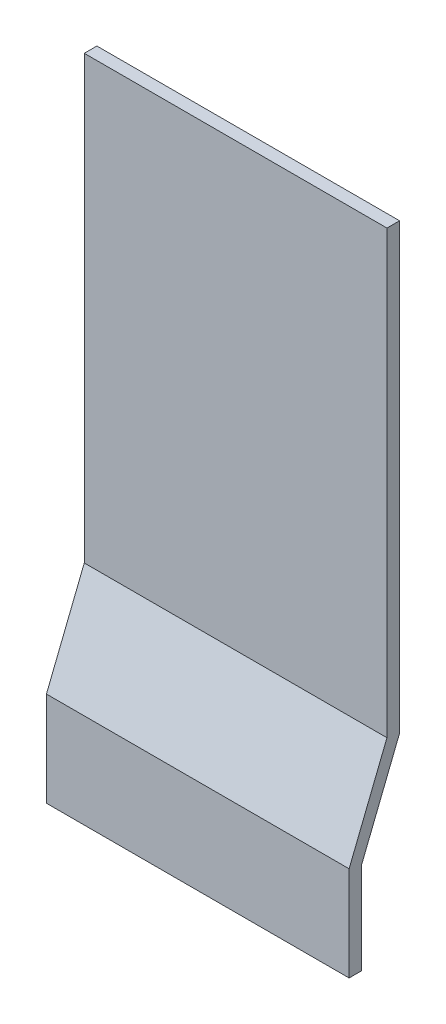
ISO-10303-21;
HEADER;
FILE_DESCRIPTION(('STEP AP214'),'2;1');
FILE_NAME('part.step','',(''),(''),'','','');
FILE_SCHEMA(('AUTOMOTIVE_DESIGN { 1 0 10303 214 1 1 1 1 }'));
ENDSEC;
DATA;
#1=APPLICATION_CONTEXT('core data for automotive mechanical design processes');
#2=APPLICATION_PROTOCOL_DEFINITION('international standard','automotive_design',2000,#1);
#3=PRODUCT_CONTEXT('',#1,'mechanical');
#4=PRODUCT('Part','Part','',(#3));
#5=PRODUCT_RELATED_PRODUCT_CATEGORY('part','',(#4));
#6=PRODUCT_DEFINITION_FORMATION('','',#4);
#7=PRODUCT_DEFINITION_CONTEXT('part definition',#1,'design');
#8=PRODUCT_DEFINITION('design','',#6,#7);
#9=PRODUCT_DEFINITION_SHAPE('','',#8);
#10=(LENGTH_UNIT() NAMED_UNIT(*) SI_UNIT(.MILLI.,.METRE.));
#11=(NAMED_UNIT(*) PLANE_ANGLE_UNIT() SI_UNIT($,.RADIAN.));
#12=(NAMED_UNIT(*) SI_UNIT($,.STERADIAN.) SOLID_ANGLE_UNIT());
#13=UNCERTAINTY_MEASURE_WITH_UNIT(LENGTH_MEASURE(1.E-05),#10,'distance_accuracy_value','');
#14=(GEOMETRIC_REPRESENTATION_CONTEXT(3) GLOBAL_UNCERTAINTY_ASSIGNED_CONTEXT((#13)) GLOBAL_UNIT_ASSIGNED_CONTEXT((#10,
#11,#12)) REPRESENTATION_CONTEXT('',''));
#15=CARTESIAN_POINT('',(0.,0.,0.));
#16=DIRECTION('',(0.,0.,1.));
#17=DIRECTION('',(1.,0.,0.));
#18=AXIS2_PLACEMENT_3D('',#15,#16,#17);
#19=CARTESIAN_POINT('',(-20.47728245926,4.697980609798,-26.23448402181));
#20=DIRECTION('',(0.,0.,-1.));
#21=DIRECTION('',(-1.,0.,0.));
#22=AXIS2_PLACEMENT_3D('',#19,#20,#21);
#23=PLANE('',#22);
#24=DIRECTION('',(0.,1.,0.));
#25=VECTOR('',#24,1.);
#26=CARTESIAN_POINT('',(-22.87728245926,4.697980609798,-26.23448402181));
#27=LINE('',#26,#25);
#28=CARTESIAN_POINT('',(-22.87728245926,3.947980609798,-26.23448402181));
#29=VERTEX_POINT('',#28);
#30=CARTESIAN_POINT('',(-22.87728245926,4.697980609798,-26.23448402181));
#31=VERTEX_POINT('',#30);
#32=EDGE_CURVE('E78',#29,#31,#27,.T.);
#33=ORIENTED_EDGE('',*,*,#32,.F.);
#34=DIRECTION('',(1.,0.,0.));
#35=VECTOR('',#34,1.);
#36=CARTESIAN_POINT('',(-20.47728245926,3.947980609798,-26.23448402181));
#37=LINE('',#36,#35);
#38=CARTESIAN_POINT('',(-20.47728245926,3.947980609798,-26.23448402181));
#39=VERTEX_POINT('',#38);
#40=EDGE_CURVE('E88',#29,#39,#37,.T.);
#41=ORIENTED_EDGE('',*,*,#40,.T.);
#42=DIRECTION('',(0.,1.,0.));
#43=VECTOR('',#42,1.);
#44=CARTESIAN_POINT('',(-20.47728245926,4.697980609798,-26.23448402181));
#45=LINE('',#44,#43);
#46=CARTESIAN_POINT('',(-20.47728245926,4.697980609798,-26.23448402181));
#47=VERTEX_POINT('',#46);
#48=EDGE_CURVE('E20',#47,#39,#45,.F.);
#49=ORIENTED_EDGE('',*,*,#48,.F.);
#50=DIRECTION('',(1.,0.,0.));
#51=VECTOR('',#50,1.);
#52=CARTESIAN_POINT('',(-20.47728245926,4.697980609798,-26.23448402181));
#53=LINE('',#52,#51);
#54=EDGE_CURVE('E86',#47,#31,#53,.F.);
#55=ORIENTED_EDGE('',*,*,#54,.T.);
#56=EDGE_LOOP('',(#33,#41,#49,#55));
#57=FACE_BOUND('',#56,.T.);
#58=ADVANCED_FACE('F17',(#57),#23,.F.);
#59=CARTESIAN_POINT('',(-20.47728245926,5.447980609798,-26.53448402181));
#60=DIRECTION('',(0.,-0.371390676354104,-0.928476690885259));
#61=DIRECTION('',(0.,0.928476690885259,-0.371390676354104));
#62=AXIS2_PLACEMENT_3D('',#59,#60,#61);
#63=PLANE('',#62);
#64=DIRECTION('',(0.,0.928476690885259,-0.371390676354104));
#65=VECTOR('',#64,1.);
#66=CARTESIAN_POINT('',(-22.87728245926,5.447980609798,-26.53448402181));
#67=LINE('',#66,#65);
#68=CARTESIAN_POINT('',(-22.87728245926,5.447980609798,-26.53448402181));
#69=VERTEX_POINT('',#68);
#70=EDGE_CURVE('E96',#31,#69,#67,.T.);
#71=ORIENTED_EDGE('',*,*,#70,.F.);
#72=ORIENTED_EDGE('',*,*,#54,.F.);
#73=DIRECTION('',(0.,0.928476690885259,-0.371390676354104));
#74=VECTOR('',#73,1.);
#75=CARTESIAN_POINT('',(-20.47728245926,5.447980609798,-26.53448402181));
#76=LINE('',#75,#74);
#77=CARTESIAN_POINT('',(-20.47728245926,5.447980609798,-26.53448402181));
#78=VERTEX_POINT('',#77);
#79=EDGE_CURVE('E94',#78,#47,#76,.F.);
#80=ORIENTED_EDGE('',*,*,#79,.F.);
#81=DIRECTION('',(1.,0.,0.));
#82=VECTOR('',#81,1.);
#83=CARTESIAN_POINT('',(-20.47728245926,5.447980609798,-26.53448402181));
#84=LINE('',#83,#82);
#85=EDGE_CURVE('E111',#78,#69,#84,.F.);
#86=ORIENTED_EDGE('',*,*,#85,.T.);
#87=EDGE_LOOP('',(#71,#72,#80,#86));
#88=FACE_BOUND('',#87,.T.);
#89=ADVANCED_FACE('F92',(#88),#63,.F.);
#90=CARTESIAN_POINT('',(-20.47728245926,3.947980609798,-26.23448402181));
#91=DIRECTION('',(0.,1.,0.));
#92=DIRECTION('',(0.,0.,1.));
#93=AXIS2_PLACEMENT_3D('',#90,#91,#92);
#94=PLANE('',#93);
#95=DIRECTION('',(0.,0.,1.));
#96=VECTOR('',#95,1.);
#97=CARTESIAN_POINT('',(-22.87728245926,3.947980609798,-26.23448402181));
#98=LINE('',#97,#96);
#99=CARTESIAN_POINT('',(-22.87728245926,3.947980609798,-26.33448402181));
#100=VERTEX_POINT('',#99);
#101=EDGE_CURVE('E108',#100,#29,#98,.T.);
#102=ORIENTED_EDGE('',*,*,#101,.F.);
#103=DIRECTION('',(1.,0.,0.));
#104=VECTOR('',#103,1.);
#105=CARTESIAN_POINT('',(-20.47728245926,3.947980609798,-26.33448402181));
#106=LINE('',#105,#104);
#107=CARTESIAN_POINT('',(-20.47728245926,3.947980609798,-26.33448402181));
#108=VERTEX_POINT('',#107);
#109=EDGE_CURVE('E113',#100,#108,#106,.T.);
#110=ORIENTED_EDGE('',*,*,#109,.T.);
#111=DIRECTION('',(0.,0.,1.));
#112=VECTOR('',#111,1.);
#113=CARTESIAN_POINT('',(-20.47728245926,3.947980609798,-26.23448402181));
#114=LINE('',#113,#112);
#115=EDGE_CURVE('E106',#39,#108,#114,.F.);
#116=ORIENTED_EDGE('',*,*,#115,.F.);
#117=ORIENTED_EDGE('',*,*,#40,.F.);
#118=EDGE_LOOP('',(#102,#110,#116,#117));
#119=FACE_BOUND('',#118,.T.);
#120=ADVANCED_FACE('F178',(#119),#94,.F.);
#121=CARTESIAN_POINT('',(-20.47728245926,8.947980609798,-26.53448402181));
#122=DIRECTION('',(0.,0.,-1.));
#123=DIRECTION('',(0.,1.,0.));
#124=AXIS2_PLACEMENT_3D('',#121,#122,#123);
#125=PLANE('',#124);
#126=DIRECTION('',(0.,1.,0.));
#127=VECTOR('',#126,1.);
#128=CARTESIAN_POINT('',(-22.87728245926,8.947980609798,-26.53448402181));
#129=LINE('',#128,#127);
#130=CARTESIAN_POINT('',(-22.87728245926,8.947980609798,-26.53448402181));
#131=VERTEX_POINT('',#130);
#132=EDGE_CURVE('E124',#131,#69,#129,.F.);
#133=ORIENTED_EDGE('',*,*,#132,.T.);
#134=ORIENTED_EDGE('',*,*,#85,.F.);
#135=DIRECTION('',(0.,1.,0.));
#136=VECTOR('',#135,1.);
#137=CARTESIAN_POINT('',(-20.47728245926,3.947980609798,-26.53448402181));
#138=LINE('',#137,#136);
#139=CARTESIAN_POINT('',(-20.47728245926,8.947980609798,-26.53448402181));
#140=VERTEX_POINT('',#139);
#141=EDGE_CURVE('E102',#140,#78,#138,.F.);
#142=ORIENTED_EDGE('',*,*,#141,.F.);
#143=DIRECTION('',(1.,0.,0.));
#144=VECTOR('',#143,1.);
#145=CARTESIAN_POINT('',(-20.47728245926,8.947980609798,-26.53448402181));
#146=LINE('',#145,#144);
#147=EDGE_CURVE('E121',#140,#131,#146,.F.);
#148=ORIENTED_EDGE('',*,*,#147,.T.);
#149=EDGE_LOOP('',(#133,#134,#142,#148));
#150=FACE_BOUND('',#149,.T.);
#151=ADVANCED_FACE('F174',(#150),#125,.F.);
#152=CARTESIAN_POINT('',(-20.47728245926,4.678722369441,-26.33448402181));
#153=DIRECTION('',(0.,0.,1.));
#154=DIRECTION('',(1.,0.,0.));
#155=AXIS2_PLACEMENT_3D('',#152,#153,#154);
#156=PLANE('',#155);
#157=DIRECTION('',(0.,1.,0.));
#158=VECTOR('',#157,1.);
#159=CARTESIAN_POINT('',(-22.87728245926,8.947980609798,-26.33448402181));
#160=LINE('',#159,#158);
#161=CARTESIAN_POINT('',(-22.87728245926,4.678722369441,-26.33448402181));
#162=VERTEX_POINT('',#161);
#163=EDGE_CURVE('E127',#100,#162,#160,.T.);
#164=ORIENTED_EDGE('',*,*,#163,.T.);
#165=DIRECTION('',(1.,0.,0.));
#166=VECTOR('',#165,1.);
#167=CARTESIAN_POINT('',(-20.47728245926,4.678722369441,-26.33448402181));
#168=LINE('',#167,#166);
#169=CARTESIAN_POINT('',(-20.47728245926,4.678722369441,-26.33448402181));
#170=VERTEX_POINT('',#169);
#171=EDGE_CURVE('E136',#162,#170,#168,.T.);
#172=ORIENTED_EDGE('',*,*,#171,.T.);
#173=DIRECTION('',(0.,1.,0.));
#174=VECTOR('',#173,1.);
#175=CARTESIAN_POINT('',(-20.47728245926,3.947980609798,-26.33448402181));
#176=LINE('',#175,#174);
#177=EDGE_CURVE('E117',#108,#170,#176,.T.);
#178=ORIENTED_EDGE('',*,*,#177,.F.);
#179=ORIENTED_EDGE('',*,*,#109,.F.);
#180=EDGE_LOOP('',(#164,#172,#178,#179));
#181=FACE_BOUND('',#180,.T.);
#182=ADVANCED_FACE('F171',(#181),#156,.F.);
#183=CARTESIAN_POINT('',(-20.47728245926,3.947980609798,-26.53448402181));
#184=DIRECTION('',(1.,0.,0.));
#185=DIRECTION('',(0.,0.,-1.));
#186=AXIS2_PLACEMENT_3D('',#183,#184,#185);
#187=PLANE('',#186);
#188=DIRECTION('',(0.,1.,0.));
#189=VECTOR('',#188,1.);
#190=CARTESIAN_POINT('',(-20.47728245926,8.947980609798,-26.63448402181));
#191=LINE('',#190,#189);
#192=CARTESIAN_POINT('',(-20.47728245926,5.428722369441,-26.63448402181));
#193=VERTEX_POINT('',#192);
#194=CARTESIAN_POINT('',(-20.47728245926,8.947980609798,-26.63448402181));
#195=VERTEX_POINT('',#194);
#196=EDGE_CURVE('E139',#193,#195,#191,.T.);
#197=ORIENTED_EDGE('',*,*,#196,.T.);
#198=DIRECTION('',(0.,0.,-1.));
#199=VECTOR('',#198,1.);
#200=CARTESIAN_POINT('',(-20.47728245926,8.947980609798,-26.53448402181));
#201=LINE('',#200,#199);
#202=EDGE_CURVE('E119',#195,#140,#201,.F.);
#203=ORIENTED_EDGE('',*,*,#202,.T.);
#204=ORIENTED_EDGE('',*,*,#141,.T.);
#205=ORIENTED_EDGE('',*,*,#79,.T.);
#206=ORIENTED_EDGE('',*,*,#48,.T.);
#207=ORIENTED_EDGE('',*,*,#115,.T.);
#208=ORIENTED_EDGE('',*,*,#177,.T.);
#209=DIRECTION('',(0.,-0.928476690885259,0.371390676354104));
#210=VECTOR('',#209,1.);
#211=CARTESIAN_POINT('',(-20.47728245926,5.428722369441,-26.63448402181));
#212=LINE('',#211,#210);
#213=EDGE_CURVE('E132',#170,#193,#212,.F.);
#214=ORIENTED_EDGE('',*,*,#213,.T.);
#215=EDGE_LOOP('',(#197,#203,#204,#205,#206,#207,#208,#214));
#216=FACE_BOUND('',#215,.T.);
#217=ADVANCED_FACE('F100',(#216),#187,.T.);
#218=CARTESIAN_POINT('',(-20.47728245926,8.947980609798,-26.53448402181));
#219=DIRECTION('',(0.,-1.,0.));
#220=DIRECTION('',(0.,0.,-1.));
#221=AXIS2_PLACEMENT_3D('',#218,#219,#220);
#222=PLANE('',#221);
#223=DIRECTION('',(0.,0.,1.));
#224=VECTOR('',#223,1.);
#225=CARTESIAN_POINT('',(-22.87728245926,8.947980609798,-21.01433076735));
#226=LINE('',#225,#224);
#227=CARTESIAN_POINT('',(-22.87728245926,8.947980609798,-26.63448402181));
#228=VERTEX_POINT('',#227);
#229=EDGE_CURVE('E129',#228,#131,#226,.T.);
#230=ORIENTED_EDGE('',*,*,#229,.T.);
#231=ORIENTED_EDGE('',*,*,#147,.F.);
#232=ORIENTED_EDGE('',*,*,#202,.F.);
#233=DIRECTION('',(1.,0.,0.));
#234=VECTOR('',#233,1.);
#235=CARTESIAN_POINT('',(-20.47728245926,8.947980609798,-26.63448402181));
#236=LINE('',#235,#234);
#237=EDGE_CURVE('E141',#195,#228,#236,.F.);
#238=ORIENTED_EDGE('',*,*,#237,.T.);
#239=EDGE_LOOP('',(#230,#231,#232,#238));
#240=FACE_BOUND('',#239,.T.);
#241=ADVANCED_FACE('F152',(#240),#222,.F.);
#242=CARTESIAN_POINT('',(-22.87728245926,8.947980609798,-21.01433076735));
#243=DIRECTION('',(1.,0.,0.));
#244=DIRECTION('',(0.,1.,0.));
#245=AXIS2_PLACEMENT_3D('',#242,#243,#244);
#246=PLANE('',#245);
#247=DIRECTION('',(0.,1.,0.));
#248=VECTOR('',#247,1.);
#249=CARTESIAN_POINT('',(-22.87728245926,8.947980609798,-26.63448402181));
#250=LINE('',#249,#248);
#251=CARTESIAN_POINT('',(-22.87728245926,5.428722369441,-26.63448402181));
#252=VERTEX_POINT('',#251);
#253=EDGE_CURVE('E26',#228,#252,#250,.F.);
#254=ORIENTED_EDGE('',*,*,#253,.T.);
#255=DIRECTION('',(0.,-0.928476690885259,0.371390676354104));
#256=VECTOR('',#255,1.);
#257=CARTESIAN_POINT('',(-22.87728245926,5.428722369441,-26.63448402181));
#258=LINE('',#257,#256);
#259=EDGE_CURVE('E34',#252,#162,#258,.T.);
#260=ORIENTED_EDGE('',*,*,#259,.T.);
#261=ORIENTED_EDGE('',*,*,#163,.F.);
#262=ORIENTED_EDGE('',*,*,#101,.T.);
#263=ORIENTED_EDGE('',*,*,#32,.T.);
#264=ORIENTED_EDGE('',*,*,#70,.T.);
#265=ORIENTED_EDGE('',*,*,#132,.F.);
#266=ORIENTED_EDGE('',*,*,#229,.F.);
#267=EDGE_LOOP('',(#254,#260,#261,#262,#263,#264,#265,#266));
#268=FACE_BOUND('',#267,.T.);
#269=ADVANCED_FACE('F146',(#268),#246,.F.);
#270=CARTESIAN_POINT('',(-20.47728245926,5.428722369441,-26.63448402181));
#271=DIRECTION('',(0.,0.371390676354104,0.928476690885259));
#272=DIRECTION('',(0.,-0.928476690885259,0.371390676354104));
#273=AXIS2_PLACEMENT_3D('',#270,#271,#272);
#274=PLANE('',#273);
#275=ORIENTED_EDGE('',*,*,#259,.F.);
#276=DIRECTION('',(1.,0.,0.));
#277=VECTOR('',#276,1.);
#278=CARTESIAN_POINT('',(-20.47728245926,5.428722369441,-26.63448402181));
#279=LINE('',#278,#277);
#280=EDGE_CURVE('E11',#252,#193,#279,.T.);
#281=ORIENTED_EDGE('',*,*,#280,.T.);
#282=ORIENTED_EDGE('',*,*,#213,.F.);
#283=ORIENTED_EDGE('',*,*,#171,.F.);
#284=EDGE_LOOP('',(#275,#281,#282,#283));
#285=FACE_BOUND('',#284,.T.);
#286=ADVANCED_FACE('F156',(#285),#274,.F.);
#287=CARTESIAN_POINT('',(-20.47728245926,8.947980609798,-26.63448402181));
#288=DIRECTION('',(0.,0.,1.));
#289=DIRECTION('',(1.,0.,0.));
#290=AXIS2_PLACEMENT_3D('',#287,#288,#289);
#291=PLANE('',#290);
#292=ORIENTED_EDGE('',*,*,#253,.F.);
#293=ORIENTED_EDGE('',*,*,#237,.F.);
#294=ORIENTED_EDGE('',*,*,#196,.F.);
#295=ORIENTED_EDGE('',*,*,#280,.F.);
#296=EDGE_LOOP('',(#292,#293,#294,#295));
#297=FACE_BOUND('',#296,.T.);
#298=ADVANCED_FACE('F150',(#297),#291,.F.);
#299=CLOSED_SHELL('',(#58,#89,#120,#151,#182,#217,#241,#269,#286,#298));
#300=MANIFOLD_SOLID_BREP('B1',#299);
#301=ADVANCED_BREP_SHAPE_REPRESENTATION('',(#18,#300),#14);
#302=SHAPE_DEFINITION_REPRESENTATION(#9,#301);
ENDSEC;
END-ISO-10303-21;
